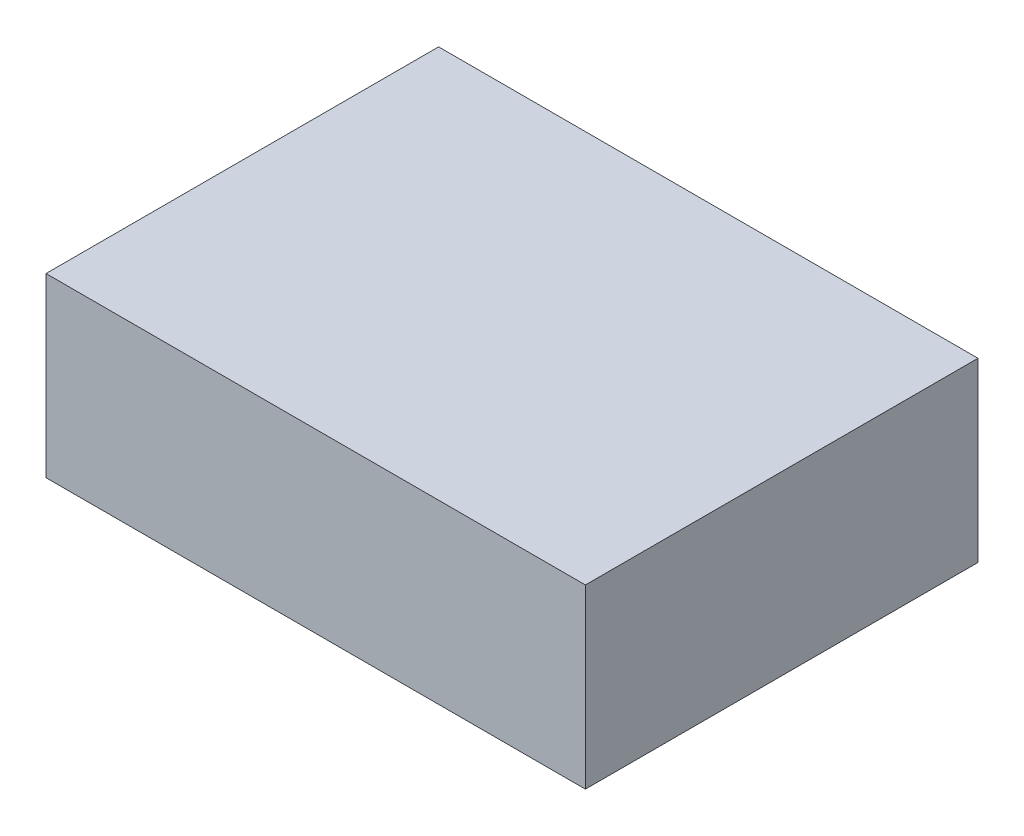
ISO-10303-21;
HEADER;
FILE_DESCRIPTION(('STEP AP214'),'2;1');
FILE_NAME('part.step','',(''),(''),'','','');
FILE_SCHEMA(('AUTOMOTIVE_DESIGN { 1 0 10303 214 1 1 1 1 }'));
ENDSEC;
DATA;
#1=APPLICATION_CONTEXT('core data for automotive mechanical design processes');
#2=APPLICATION_PROTOCOL_DEFINITION('international standard','automotive_design',2000,#1);
#3=PRODUCT_CONTEXT('',#1,'mechanical');
#4=PRODUCT('Part','Part','',(#3));
#5=PRODUCT_RELATED_PRODUCT_CATEGORY('part','',(#4));
#6=PRODUCT_DEFINITION_FORMATION('','',#4);
#7=PRODUCT_DEFINITION_CONTEXT('part definition',#1,'design');
#8=PRODUCT_DEFINITION('design','',#6,#7);
#9=PRODUCT_DEFINITION_SHAPE('','',#8);
#10=(LENGTH_UNIT() NAMED_UNIT(*) SI_UNIT(.MILLI.,.METRE.));
#11=(NAMED_UNIT(*) PLANE_ANGLE_UNIT() SI_UNIT($,.RADIAN.));
#12=(NAMED_UNIT(*) SI_UNIT($,.STERADIAN.) SOLID_ANGLE_UNIT());
#13=UNCERTAINTY_MEASURE_WITH_UNIT(LENGTH_MEASURE(1.E-05),#10,'distance_accuracy_value','');
#14=(GEOMETRIC_REPRESENTATION_CONTEXT(3) GLOBAL_UNCERTAINTY_ASSIGNED_CONTEXT((#13)) GLOBAL_UNIT_ASSIGNED_CONTEXT((#10,
#11,#12)) REPRESENTATION_CONTEXT('',''));
#15=CARTESIAN_POINT('',(0.,0.,0.));
#16=DIRECTION('',(0.,0.,1.));
#17=DIRECTION('',(1.,0.,0.));
#18=AXIS2_PLACEMENT_3D('',#15,#16,#17);
#19=CARTESIAN_POINT('',(-7.66854119914543,10.,-66.1472946419774));
#20=DIRECTION('',(-1.,0.,0.));
#21=DIRECTION('',(0.,0.,1.));
#22=AXIS2_PLACEMENT_3D('',#19,#20,#21);
#23=PLANE('',#22);
#24=DIRECTION('',(0.,0.,-1.));
#25=VECTOR('',#24,1.);
#26=CARTESIAN_POINT('',(-7.66854119914543,0.,-66.1472946419774));
#27=LINE('',#26,#25);
#28=CARTESIAN_POINT('',(-7.66854119914543,0.,-43.9472946419774));
#29=VERTEX_POINT('',#28);
#30=CARTESIAN_POINT('',(-7.66854119914543,0.,-66.1472946419774));
#31=VERTEX_POINT('',#30);
#32=EDGE_CURVE('E113',#29,#31,#27,.T.);
#33=ORIENTED_EDGE('',*,*,#32,.T.);
#34=DIRECTION('',(0.,-1.,0.));
#35=VECTOR('',#34,1.);
#36=CARTESIAN_POINT('',(-7.66854119914543,10.,-66.1472946419774));
#37=LINE('',#36,#35);
#38=CARTESIAN_POINT('',(-7.66854119914543,10.,-66.1472946419774));
#39=VERTEX_POINT('',#38);
#40=EDGE_CURVE('E11',#39,#31,#37,.T.);
#41=ORIENTED_EDGE('',*,*,#40,.F.);
#42=DIRECTION('',(0.,0.,-1.));
#43=VECTOR('',#42,1.);
#44=CARTESIAN_POINT('',(-7.66854119914543,10.,-66.1472946419774));
#45=LINE('',#44,#43);
#46=CARTESIAN_POINT('',(-7.66854119914543,10.,-43.9472946419774));
#47=VERTEX_POINT('',#46);
#48=EDGE_CURVE('E97',#47,#39,#45,.T.);
#49=ORIENTED_EDGE('',*,*,#48,.F.);
#50=DIRECTION('',(0.,-1.,0.));
#51=VECTOR('',#50,1.);
#52=CARTESIAN_POINT('',(-7.66854119914543,10.,-43.9472946419774));
#53=LINE('',#52,#51);
#54=EDGE_CURVE('E109',#47,#29,#53,.T.);
#55=ORIENTED_EDGE('',*,*,#54,.T.);
#56=EDGE_LOOP('',(#33,#41,#49,#55));
#57=FACE_BOUND('',#56,.T.);
#58=ADVANCED_FACE('F45',(#57),#23,.F.);
#59=CARTESIAN_POINT('',(-38.1685411991454,10.,-66.1472946419774));
#60=DIRECTION('',(0.,0.,1.));
#61=DIRECTION('',(1.,0.,0.));
#62=AXIS2_PLACEMENT_3D('',#59,#60,#61);
#63=PLANE('',#62);
#64=DIRECTION('',(-1.,0.,0.));
#65=VECTOR('',#64,1.);
#66=CARTESIAN_POINT('',(-38.1685411991454,0.,-66.1472946419774));
#67=LINE('',#66,#65);
#68=CARTESIAN_POINT('',(-38.1685411991454,0.,-66.1472946419774));
#69=VERTEX_POINT('',#68);
#70=EDGE_CURVE('E102',#31,#69,#67,.T.);
#71=ORIENTED_EDGE('',*,*,#70,.T.);
#72=DIRECTION('',(0.,-1.,0.));
#73=VECTOR('',#72,1.);
#74=CARTESIAN_POINT('',(-38.1685411991454,10.,-66.1472946419774));
#75=LINE('',#74,#73);
#76=CARTESIAN_POINT('',(-38.1685411991454,10.,-66.1472946419774));
#77=VERTEX_POINT('',#76);
#78=EDGE_CURVE('E54',#77,#69,#75,.T.);
#79=ORIENTED_EDGE('',*,*,#78,.F.);
#80=DIRECTION('',(-1.,0.,0.));
#81=VECTOR('',#80,1.);
#82=CARTESIAN_POINT('',(-38.1685411991454,10.,-66.1472946419774));
#83=LINE('',#82,#81);
#84=EDGE_CURVE('E92',#39,#77,#83,.T.);
#85=ORIENTED_EDGE('',*,*,#84,.F.);
#86=ORIENTED_EDGE('',*,*,#40,.T.);
#87=EDGE_LOOP('',(#71,#79,#85,#86));
#88=FACE_BOUND('',#87,.T.);
#89=ADVANCED_FACE('F101',(#88),#63,.F.);
#90=CARTESIAN_POINT('',(-38.1685411991454,10.,-66.1472946419774));
#91=DIRECTION('',(1.,0.,0.));
#92=DIRECTION('',(0.,0.,-1.));
#93=AXIS2_PLACEMENT_3D('',#90,#91,#92);
#94=PLANE('',#93);
#95=DIRECTION('',(0.,0.,1.));
#96=VECTOR('',#95,1.);
#97=CARTESIAN_POINT('',(-38.1685411991454,0.,-66.1472946419774));
#98=LINE('',#97,#96);
#99=CARTESIAN_POINT('',(-38.1685411991454,0.,-43.9472946419774));
#100=VERTEX_POINT('',#99);
#101=EDGE_CURVE('E79',#69,#100,#98,.T.);
#102=ORIENTED_EDGE('',*,*,#101,.T.);
#103=DIRECTION('',(0.,-1.,0.));
#104=VECTOR('',#103,1.);
#105=CARTESIAN_POINT('',(-38.1685411991454,10.,-43.9472946419774));
#106=LINE('',#105,#104);
#107=CARTESIAN_POINT('',(-38.1685411991454,10.,-43.9472946419774));
#108=VERTEX_POINT('',#107);
#109=EDGE_CURVE('E104',#108,#100,#106,.T.);
#110=ORIENTED_EDGE('',*,*,#109,.F.);
#111=DIRECTION('',(0.,0.,1.));
#112=VECTOR('',#111,1.);
#113=CARTESIAN_POINT('',(-38.1685411991454,10.,-66.1472946419774));
#114=LINE('',#113,#112);
#115=EDGE_CURVE('E95',#77,#108,#114,.T.);
#116=ORIENTED_EDGE('',*,*,#115,.F.);
#117=ORIENTED_EDGE('',*,*,#78,.T.);
#118=EDGE_LOOP('',(#102,#110,#116,#117));
#119=FACE_BOUND('',#118,.T.);
#120=ADVANCED_FACE('F105',(#119),#94,.F.);
#121=CARTESIAN_POINT('',(-38.1685411991454,10.,-43.9472946419774));
#122=DIRECTION('',(0.,0.,-1.));
#123=DIRECTION('',(-1.,0.,0.));
#124=AXIS2_PLACEMENT_3D('',#121,#122,#123);
#125=PLANE('',#124);
#126=DIRECTION('',(1.,0.,0.));
#127=VECTOR('',#126,1.);
#128=CARTESIAN_POINT('',(-38.1685411991454,0.,-43.9472946419774));
#129=LINE('',#128,#127);
#130=EDGE_CURVE('E85',#100,#29,#129,.T.);
#131=ORIENTED_EDGE('',*,*,#130,.T.);
#132=ORIENTED_EDGE('',*,*,#54,.F.);
#133=DIRECTION('',(1.,0.,0.));
#134=VECTOR('',#133,1.);
#135=CARTESIAN_POINT('',(-38.1685411991454,10.,-43.9472946419774));
#136=LINE('',#135,#134);
#137=EDGE_CURVE('E62',#108,#47,#136,.T.);
#138=ORIENTED_EDGE('',*,*,#137,.F.);
#139=ORIENTED_EDGE('',*,*,#109,.T.);
#140=EDGE_LOOP('',(#131,#132,#138,#139));
#141=FACE_BOUND('',#140,.T.);
#142=ADVANCED_FACE('F126',(#141),#125,.F.);
#143=CARTESIAN_POINT('',(0.,10.,0.));
#144=DIRECTION('',(0.,1.,0.));
#145=DIRECTION('',(0.,0.,1.));
#146=AXIS2_PLACEMENT_3D('',#143,#144,#145);
#147=PLANE('',#146);
#148=ORIENTED_EDGE('',*,*,#48,.T.);
#149=ORIENTED_EDGE('',*,*,#84,.T.);
#150=ORIENTED_EDGE('',*,*,#115,.T.);
#151=ORIENTED_EDGE('',*,*,#137,.T.);
#152=EDGE_LOOP('',(#148,#149,#150,#151));
#153=FACE_BOUND('',#152,.T.);
#154=ADVANCED_FACE('F93',(#153),#147,.T.);
#155=CARTESIAN_POINT('',(0.,0.,0.));
#156=DIRECTION('',(0.,1.,0.));
#157=DIRECTION('',(0.,0.,1.));
#158=AXIS2_PLACEMENT_3D('',#155,#156,#157);
#159=PLANE('',#158);
#160=ORIENTED_EDGE('',*,*,#32,.F.);
#161=ORIENTED_EDGE('',*,*,#130,.F.);
#162=ORIENTED_EDGE('',*,*,#101,.F.);
#163=ORIENTED_EDGE('',*,*,#70,.F.);
#164=EDGE_LOOP('',(#160,#161,#162,#163));
#165=FACE_BOUND('',#164,.T.);
#166=ADVANCED_FACE('F129',(#165),#159,.F.);
#167=CLOSED_SHELL('',(#58,#89,#120,#142,#154,#166));
#168=MANIFOLD_SOLID_BREP('B2',#167);
#169=ADVANCED_BREP_SHAPE_REPRESENTATION('',(#18,#168),#14);
#170=SHAPE_DEFINITION_REPRESENTATION(#9,#169);
ENDSEC;
END-ISO-10303-21;
